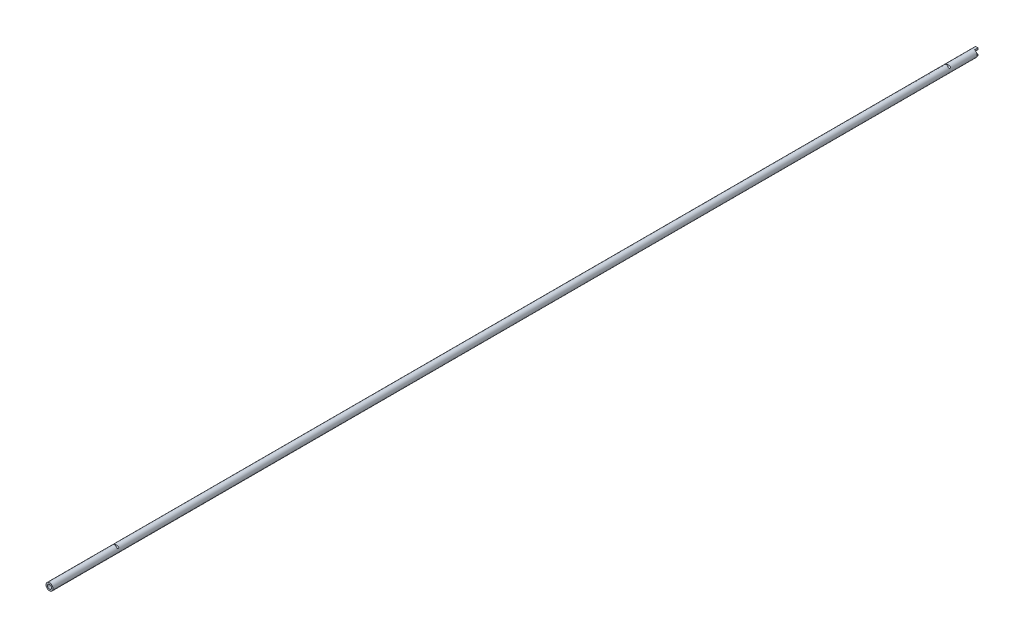
ISO-10303-21;
HEADER;
FILE_DESCRIPTION(('STEP AP214'),'2;1');
FILE_NAME('part.step','',(''),(''),'','','');
FILE_SCHEMA(('AUTOMOTIVE_DESIGN { 1 0 10303 214 1 1 1 1 }'));
ENDSEC;
DATA;
#1=APPLICATION_CONTEXT('core data for automotive mechanical design processes');
#2=APPLICATION_PROTOCOL_DEFINITION('international standard','automotive_design',2000,#1);
#3=PRODUCT_CONTEXT('',#1,'mechanical');
#4=PRODUCT('Part','Part','',(#3));
#5=PRODUCT_RELATED_PRODUCT_CATEGORY('part','',(#4));
#6=PRODUCT_DEFINITION_FORMATION('','',#4);
#7=PRODUCT_DEFINITION_CONTEXT('part definition',#1,'design');
#8=PRODUCT_DEFINITION('design','',#6,#7);
#9=PRODUCT_DEFINITION_SHAPE('','',#8);
#10=(LENGTH_UNIT() NAMED_UNIT(*) SI_UNIT(.MILLI.,.METRE.));
#11=(NAMED_UNIT(*) PLANE_ANGLE_UNIT() SI_UNIT($,.RADIAN.));
#12=(NAMED_UNIT(*) SI_UNIT($,.STERADIAN.) SOLID_ANGLE_UNIT());
#13=UNCERTAINTY_MEASURE_WITH_UNIT(LENGTH_MEASURE(1.E-05),#10,'distance_accuracy_value','');
#14=(GEOMETRIC_REPRESENTATION_CONTEXT(3) GLOBAL_UNCERTAINTY_ASSIGNED_CONTEXT((#13)) GLOBAL_UNIT_ASSIGNED_CONTEXT((#10,
#11,#12)) REPRESENTATION_CONTEXT('',''));
#15=CARTESIAN_POINT('',(0.,0.,0.));
#16=DIRECTION('',(0.,0.,1.));
#17=DIRECTION('',(1.,0.,0.));
#18=AXIS2_PLACEMENT_3D('',#15,#16,#17);
#19=CARTESIAN_POINT('',(0.,0.,0.));
#20=DIRECTION('',(0.,0.,1.));
#21=DIRECTION('',(1.,0.,0.));
#22=AXIS2_PLACEMENT_3D('',#19,#20,#21);
#23=PLANE('',#22);
#24=DIRECTION('',(0.,-1.,0.));
#25=VECTOR('',#24,1.);
#26=CARTESIAN_POINT('',(0.5,-3.,0.));
#27=LINE('',#26,#25);
#28=CARTESIAN_POINT('',(0.5,-1.00778221853732,0.));
#29=VERTEX_POINT('',#28);
#30=CARTESIAN_POINT('',(0.5,-1.91582880237249,0.));
#31=VERTEX_POINT('',#30);
#32=EDGE_CURVE('E81',#29,#31,#27,.T.);
#33=ORIENTED_EDGE('',*,*,#32,.T.);
#34=CARTESIAN_POINT('',(0.,0.,0.));
#35=DIRECTION('',(0.,0.,1.));
#36=DIRECTION('',(1.,0.,0.));
#37=AXIS2_PLACEMENT_3D('',#34,#35,#36);
#38=CIRCLE('',#37,1.98);
#39=CARTESIAN_POINT('',(0.5,1.91582880237249,0.));
#40=VERTEX_POINT('',#39);
#41=EDGE_CURVE('E86',#40,#31,#38,.T.);
#42=ORIENTED_EDGE('',*,*,#41,.F.);
#43=CARTESIAN_POINT('',(0.5,1.00778221853732,0.));
#44=VERTEX_POINT('',#43);
#45=EDGE_CURVE('E71',#40,#44,#27,.T.);
#46=ORIENTED_EDGE('',*,*,#45,.T.);
#47=CARTESIAN_POINT('',(0.,0.,0.));
#48=DIRECTION('',(0.,0.,1.));
#49=DIRECTION('',(1.,0.,0.));
#50=AXIS2_PLACEMENT_3D('',#47,#48,#49);
#51=CIRCLE('',#50,1.125);
#52=EDGE_CURVE('E97',#44,#29,#51,.T.);
#53=ORIENTED_EDGE('',*,*,#52,.T.);
#54=EDGE_LOOP('',(#33,#42,#46,#53));
#55=FACE_BOUND('',#54,.T.);
#56=ADVANCED_FACE('F31',(#55),#23,.F.);
#57=CARTESIAN_POINT('',(0.,0.,522.));
#58=DIRECTION('',(0.,0.,-1.));
#59=DIRECTION('',(-1.,0.,0.));
#60=AXIS2_PLACEMENT_3D('',#57,#58,#59);
#61=CYLINDRICAL_SURFACE('',#60,1.98);
#62=CARTESIAN_POINT('',(0.,0.,522.));
#63=DIRECTION('',(0.,0.,1.));
#64=DIRECTION('',(1.,0.,0.));
#65=AXIS2_PLACEMENT_3D('',#62,#63,#64);
#66=CIRCLE('',#65,1.98);
#67=CARTESIAN_POINT('',(1.98,0.,522.));
#68=VERTEX_POINT('',#67);
#69=EDGE_CURVE('E90',#68,#68,#66,.T.);
#70=ORIENTED_EDGE('',*,*,#69,.F.);
#71=EDGE_LOOP('',(#70));
#72=FACE_BOUND('',#71,.T.);
#73=CARTESIAN_POINT('',(-1.29243955371228,1.5,484.5));
#74=CARTESIAN_POINT('',(-1.2425389474271,1.54299057509264,484.499995399884));
#75=CARTESIAN_POINT('',(-1.19047392231772,1.58347850851822,484.505508981067));
#76=CARTESIAN_POINT('',(-1.08343395994787,1.65857997671562,484.524229338989));
#77=CARTESIAN_POINT('',(-1.02844770339114,1.69316808435268,484.537468379666));
#78=CARTESIAN_POINT('',(-0.927935323019706,1.74984443231153,484.565986907975));
#79=CARTESIAN_POINT('',(-0.882750131221038,1.77304535126958,484.580309265285));
#80=CARTESIAN_POINT('',(-0.791398755927703,1.81566270412915,484.611344998857));
#81=CARTESIAN_POINT('',(-0.745231912553682,1.83507649695735,484.628060029743));
#82=CARTESIAN_POINT('',(-0.651849804804599,1.87029295163725,484.663100115686));
#83=CARTESIAN_POINT('',(-0.604630419985961,1.88607686066688,484.681432883234));
#84=CARTESIAN_POINT('',(-0.509392580614743,1.91399586955475,484.718664103806));
#85=CARTESIAN_POINT('',(-0.461374601197777,1.92613306250905,484.737562225461));
#86=CARTESIAN_POINT('',(-0.360997039527152,1.94753669014353,484.77591783551));
#87=CARTESIAN_POINT('',(-0.308562990694924,1.95655445010748,484.795327153863));
#88=CARTESIAN_POINT('',(-0.22872453128644,1.96692338058287,484.820918499651));
#89=CARTESIAN_POINT('',(-0.202090998477371,1.96984440731773,484.828821563424));
#90=CARTESIAN_POINT('',(-0.148224117196186,1.9746301218412,484.842593790329));
#91=CARTESIAN_POINT('',(-0.120991479330969,1.97649599766511,484.848465238035));
#92=CARTESIAN_POINT('',(-0.0537707003767061,1.97966281507022,484.858667893243));
#93=CARTESIAN_POINT('',(-0.0134226939209415,1.98035783807444,484.861196492443));
#94=CARTESIAN_POINT('',(0.0669997380799987,1.97927973122775,484.857563998987));
#95=CARTESIAN_POINT('',(0.107071100296893,1.97749186794063,484.85135103103));
#96=CARTESIAN_POINT('',(0.194521419191953,1.97101763019431,484.831900637824));
#97=CARTESIAN_POINT('',(0.241530696902491,1.96577249467755,484.817403089104));
#98=CARTESIAN_POINT('',(0.334256756651982,1.95214388781263,484.785822963867));
#99=CARTESIAN_POINT('',(0.379969885338665,1.94375234271596,484.768733804995));
#100=CARTESIAN_POINT('',(0.470905320529795,1.92375480216822,484.73384143126));
#101=CARTESIAN_POINT('',(0.516119610868044,1.91212079962062,484.716033206489));
#102=CARTESIAN_POINT('',(0.605740692022154,1.88564557850313,484.681000126433));
#103=CARTESIAN_POINT('',(0.650148447531186,1.8708085084495,484.66377454959));
#104=CARTESIAN_POINT('',(0.770935820794457,1.82558570902771,484.618356590295));
#105=CARTESIAN_POINT('',(0.846634575466666,1.79182299971131,484.591491118236));
#106=CARTESIAN_POINT('',(0.957774985659008,1.73343901883518,484.557266659132));
#107=CARTESIAN_POINT('',(0.994368395059784,1.71272386397189,484.54688164087));
#108=CARTESIAN_POINT('',(1.06661052490458,1.66869091295037,484.528714351692));
#109=CARTESIAN_POINT('',(1.10225987616208,1.64537491188653,484.520930300244));
#110=CARTESIAN_POINT('',(1.17841918111783,1.5919321699588,484.507624992223));
#111=CARTESIAN_POINT('',(1.21870739676491,1.56132427402965,484.502725293343));
#112=CARTESIAN_POINT('',(1.29698308764005,1.49692709137292,484.49897275642));
#113=CARTESIAN_POINT('',(1.33497331533841,1.46314173967792,484.50011253334));
#114=CARTESIAN_POINT('',(1.39986058382865,1.40084150657203,484.509151431277));
#115=CARTESIAN_POINT('',(1.42738088148496,1.37276519308707,484.515536812193));
#116=CARTESIAN_POINT('',(1.47981222055676,1.31606880895236,484.534107607322));
#117=CARTESIAN_POINT('',(1.50472672580005,1.28744952146375,484.546285199386));
#118=CARTESIAN_POINT('',(1.54608832668868,1.23726620100832,484.57385402592));
#119=CARTESIAN_POINT('',(1.56319238779426,1.21553519132598,484.587948854681));
#120=CARTESIAN_POINT('',(1.59498928616176,1.1734998682079,484.6203934902));
#121=CARTESIAN_POINT('',(1.60968306160285,1.15319500142876,484.638741634656));
#122=CARTESIAN_POINT('',(1.63640788913332,1.11495261267294,484.679795141432));
#123=CARTESIAN_POINT('',(1.64841667126551,1.09703535476532,484.702534226151));
#124=CARTESIAN_POINT('',(1.66931844896994,1.06496225592531,484.751799210388));
#125=CARTESIAN_POINT('',(1.67821357379962,1.05080384613205,484.778322504555));
#126=CARTESIAN_POINT('',(1.6917224810794,1.02889185071128,484.830453260387));
#127=CARTESIAN_POINT('',(1.69675276974183,1.0205307737746,484.855698843924));
#128=CARTESIAN_POINT('',(1.70428755282627,1.00789835387624,484.907552256623));
#129=CARTESIAN_POINT('',(1.7067934155452,1.00362479544913,484.934159339595));
#130=CARTESIAN_POINT('',(1.70915519503846,0.999596416223082,484.98561098079));
#131=CARTESIAN_POINT('',(1.70921232766306,0.999498481861305,485.010420262358));
#132=CARTESIAN_POINT('',(1.70718214549105,1.00296220581874,485.059689084896));
#133=CARTESIAN_POINT('',(1.70509532165559,1.00652302629143,485.084148704639));
#134=CARTESIAN_POINT('',(1.69884588491489,1.01703431002156,485.131628657877));
#135=CARTESIAN_POINT('',(1.6947171064988,1.02392948411732,485.154665785105));
#136=CARTESIAN_POINT('',(1.68444215013575,1.04074548301759,485.199123817516));
#137=CARTESIAN_POINT('',(1.67829584570709,1.05066649751377,485.220544621266));
#138=CARTESIAN_POINT('',(1.6638228467858,1.07344338237103,485.261966616591));
#139=CARTESIAN_POINT('',(1.65543055966809,1.08638572683818,485.281897100842));
#140=CARTESIAN_POINT('',(1.63669779700143,1.11440751291463,485.319159098493));
#141=CARTESIAN_POINT('',(1.62635690378808,1.12948741251566,485.336490053276));
#142=CARTESIAN_POINT('',(1.60287986678945,1.16259300992371,485.369805875973));
#143=CARTESIAN_POINT('',(1.5895759841589,1.18076166434902,485.385529561474));
#144=CARTESIAN_POINT('',(1.56110199700591,1.2181606483445,485.413661038774));
#145=CARTESIAN_POINT('',(1.54593065516565,1.23739167710834,485.426066614645));
#146=CARTESIAN_POINT('',(1.50651990798003,1.28536031910428,485.452763101226));
#147=CARTESIAN_POINT('',(1.48135055703011,1.31434983631216,485.465236298156));
#148=CARTESIAN_POINT('',(1.42832263088195,1.3718001939425,485.484236298028));
#149=CARTESIAN_POINT('',(1.40045891145492,1.40025989421608,485.490751467447));
#150=CARTESIAN_POINT('',(1.33025691305691,1.4676802023986,485.500564016687));
#151=CARTESIAN_POINT('',(1.28684754331158,1.50589257629642,485.501272192347));
#152=CARTESIAN_POINT('',(1.19720223374585,1.57811403467986,485.495193011207));
#153=CARTESIAN_POINT('',(1.1509616919135,1.61211598873388,485.488393127331));
#154=CARTESIAN_POINT('',(1.06699590962419,1.66849696525275,485.47145638521));
#155=CARTESIAN_POINT('',(1.02964819787817,1.69178368721401,485.462389630505));
#156=CARTESIAN_POINT('',(0.95401677871399,1.73555832403956,485.4417004131));
#157=CARTESIAN_POINT('',(0.915732459823221,1.75604434966897,485.430076238927));
#158=CARTESIAN_POINT('',(0.799354675223509,1.81354633409486,485.392176081393));
#159=CARTESIAN_POINT('',(0.720107822723038,1.84635971886082,485.362959595014));
#160=CARTESIAN_POINT('',(0.596624773951927,1.88852357199507,485.315502753243));
#161=CARTESIAN_POINT('',(0.553150046817475,1.90170620113528,485.298436574337));
#162=CARTESIAN_POINT('',(0.465355957154523,1.92507384476332,485.264088759105));
#163=CARTESIAN_POINT('',(0.421035080891888,1.93525281873814,485.246806760489));
#164=CARTESIAN_POINT('',(0.332221827244607,1.95244629253874,485.213617508174));
#165=CARTESIAN_POINT('',(0.287746441345688,1.95951372824515,485.197691304867));
#166=CARTESIAN_POINT('',(0.197324771769674,1.97066515137824,485.169415328055));
#167=CARTESIAN_POINT('',(0.151385663990485,1.97476188217557,485.157050417164));
#168=CARTESIAN_POINT('',(0.0853757820768558,1.97825141722084,485.145907901098));
#169=CARTESIAN_POINT('',(0.0660399338863692,1.97899343914674,485.143418218213));
#170=CARTESIAN_POINT('',(0.0272113579580723,1.979908453452,485.140319621402));
#171=CARTESIAN_POINT('',(0.00771875088914758,1.98008184804194,485.139709378099));
#172=CARTESIAN_POINT('',(-0.0507133702426767,1.9797315556929,485.140940222663));
#173=CARTESIAN_POINT('',(-0.0895909543326028,1.97833652612027,485.14584593297));
#174=CARTESIAN_POINT('',(-0.17184917589707,1.97302915467368,485.16221383));
#175=CARTESIAN_POINT('',(-0.214996583299032,1.96876092843801,485.17457251831));
#176=CARTESIAN_POINT('',(-0.300090364524257,1.95759685108264,485.202072282246));
#177=CARTESIAN_POINT('',(-0.34203311193367,1.95069381121737,485.217220910821));
#178=CARTESIAN_POINT('',(-0.425673130100529,1.93417780143086,485.248614146769));
#179=CARTESIAN_POINT('',(-0.467358373064541,1.92452759451846,485.264871301597));
#180=CARTESIAN_POINT('',(-0.550001983414324,1.90255718472927,485.297205884567));
#181=CARTESIAN_POINT('',(-0.590961225229487,1.89024046889115,485.313283518867));
#182=CARTESIAN_POINT('',(-0.720434884318597,1.84665839679133,485.363165659877));
#183=CARTESIAN_POINT('',(-0.807942738804649,1.81020200184024,485.395464321881));
#184=CARTESIAN_POINT('',(-0.936084844687591,1.74539884469068,485.436381300634));
#185=CARTESIAN_POINT('',(-0.978168609555822,1.72218814885316,485.44874162515));
#186=CARTESIAN_POINT('',(-1.06112084574702,1.67235136707114,485.470137351687));
#187=CARTESIAN_POINT('',(-1.10199060155554,1.64572906176897,485.479176392006));
#188=CARTESIAN_POINT('',(-1.18118742674323,1.58980790851122,485.492689231832));
#189=CARTESIAN_POINT('',(-1.21955194843476,1.56058842064061,485.497267169679));
#190=CARTESIAN_POINT('',(-1.29421381934286,1.49924518184436,485.500941196703));
#191=CARTESIAN_POINT('',(-1.33051242581125,1.46712322874873,485.500040656709));
#192=CARTESIAN_POINT('',(-1.39463783661039,1.40606572105812,485.491900830439));
#193=CARTESIAN_POINT('',(-1.42288958741361,1.37744558369565,485.48570151981));
#194=CARTESIAN_POINT('',(-1.47670265710241,1.31958330785169,485.467298226666));
#195=CARTESIAN_POINT('',(-1.50226784623963,1.29034213915937,485.455103029827));
#196=CARTESIAN_POINT('',(-1.54430086866224,1.23949849702138,485.427512383048));
#197=CARTESIAN_POINT('',(-1.56149245709222,1.21772054087896,485.413549428843));
#198=CARTESIAN_POINT('',(-1.59347357154777,1.17555950118734,485.381366223341));
#199=CARTESIAN_POINT('',(-1.60826408935443,1.15517584373565,485.363147737447));
#200=CARTESIAN_POINT('',(-1.63519063343644,1.11673998258229,485.322340028014));
#201=CARTESIAN_POINT('',(-1.64730436272868,1.09870784028708,485.299716843124));
#202=CARTESIAN_POINT('',(-1.66841940688443,1.06637319292887,485.25065605032));
#203=CARTESIAN_POINT('',(-1.67742282187061,1.05206817287728,485.224221033364));
#204=CARTESIAN_POINT('',(-1.69114202490515,1.02984779489591,485.172185107904));
#205=CARTESIAN_POINT('',(-1.69627092088917,1.02133276794073,485.146947867889));
#206=CARTESIAN_POINT('',(-1.70399339036075,1.00839692228425,485.095075947843));
#207=CARTESIAN_POINT('',(-1.70658834816934,1.00397386815828,485.06844203922));
#208=CARTESIAN_POINT('',(-1.70910909924263,0.999675574278743,485.016942315836));
#209=CARTESIAN_POINT('',(-1.70923991053268,0.999451029473879,484.992114846078));
#210=CARTESIAN_POINT('',(-1.70735350547264,1.00267020352344,484.942785487486));
#211=CARTESIAN_POINT('',(-1.70533679000971,1.00611306699498,484.918283524082));
#212=CARTESIAN_POINT('',(-1.69922504563514,1.01639990952753,484.870720546983));
#213=CARTESIAN_POINT('',(-1.69516579961811,1.02318528974381,484.84764215547));
#214=CARTESIAN_POINT('',(-1.68502860898484,1.03979453603864,484.803082604735));
#215=CARTESIAN_POINT('',(-1.67895054015077,1.04961858908365,484.781601543896));
#216=CARTESIAN_POINT('',(-1.6646194876178,1.07220600199503,484.740059120452));
#217=CARTESIAN_POINT('',(-1.65630248337853,1.0850541969284,484.720066201585));
#218=CARTESIAN_POINT('',(-1.63771926529289,1.11290411032858,484.682665748489));
#219=CARTESIAN_POINT('',(-1.62745269824235,1.12790621890167,484.665258683762));
#220=CARTESIAN_POINT('',(-1.60414126089142,1.16084959421683,484.631793471622));
#221=CARTESIAN_POINT('',(-1.59093068570721,1.17893354496557,484.615992128616));
#222=CARTESIAN_POINT('',(-1.56263927764177,1.21618576100403,484.587691760744));
#223=CARTESIAN_POINT('',(-1.54755688573085,1.23535492283787,484.575195516173));
#224=CARTESIAN_POINT('',(-1.5084091130199,1.28313706926132,484.548302338409));
#225=CARTESIAN_POINT('',(-1.48341954980468,1.31201036305668,484.5357075766));
#226=CARTESIAN_POINT('',(-1.43076856097238,1.369240775342,484.51645321239));
#227=CARTESIAN_POINT('',(-1.40310461573342,1.39759737655735,484.509799268624));
#228=CARTESIAN_POINT('',(-1.34790540296918,1.45083234907983,484.501751960621));
#229=CARTESIAN_POINT('',(-1.32051505251853,1.47581228106136,484.500002588156));
#230=CARTESIAN_POINT('',(-1.29243955371228,1.5,484.5));
#231=B_SPLINE_CURVE_WITH_KNOTS('',3,(#73,#74,#75,#76,#77,#78,#79,#80,#81,#82,#83,#84,#85,#86,
#87,#88,#89,#90,#91,#92,#93,#94,#95,#96,#97,#98,#99,#100,#101,#102,#103,#104,#105,#106,#107,
#108,#109,#110,#111,#112,#113,#114,#115,#116,#117,#118,#119,#120,#121,#122,#123,#124,#125,#126,
#127,#128,#129,#130,#131,#132,#133,#134,#135,#136,#137,#138,#139,#140,#141,#142,#143,#144,#145,
#146,#147,#148,#149,#150,#151,#152,#153,#154,#155,#156,#157,#158,#159,#160,#161,#162,#163,#164,
#165,#166,#167,#168,#169,#170,#171,#172,#173,#174,#175,#176,#177,#178,#179,#180,#181,#182,#183,
#184,#185,#186,#187,#188,#189,#190,#191,#192,#193,#194,#195,#196,#197,#198,#199,#200,#201,#202,
#203,#204,#205,#206,#207,#208,#209,#210,#211,#212,#213,#214,#215,#216,#217,#218,#219,#220,#221,
#222,#223,#224,#225,#226,#227,#228,#229,#230),.UNSPECIFIED.,.T.,.F.,(4,2,2,2,2,2,2,2,2,2,2,2,2,
2,2,2,2,2,2,2,2,2,2,2,2,2,2,2,2,2,2,2,2,2,2,2,2,2,2,2,2,2,2,2,2,2,2,2,2,2,2,2,2,2,2,2,2,2,2,2,2,
2,2,2,2,2,2,2,2,2,2,2,2,2,2,2,2,2,4),(0.,0.19745979712818,0.39575021071411,0.553858524046532,
0.712076708141137,0.871094787957271,1.03002142145652,1.19966144685842,1.28339788572695,
1.36703985380876,1.48733678618054,1.6083506181656,1.75642554653167,1.90488306771142,
2.05466492126217,2.20425393343168,2.46463780357882,2.5944481117484,2.7241693733028,
2.87625710163995,3.02815890092498,3.14723850934875,3.26615776015639,3.35891465197994,
3.45163535301129,3.54509870811502,3.63849802337639,3.71925664612599,3.79997147225487,
3.87403992433136,3.94809141868067,4.02095506032273,4.09382327076713,4.16910981681471,
4.24441251817947,4.32648662408198,4.40861540532754,4.52903600681914,4.6496912401668,
4.8222405309063,4.99507815297783,5.12970451667404,5.26442125037054,5.53520194898285,
5.68072889427659,5.82654653818262,5.96977729855767,6.11238995049339,6.17083176247054,
6.22923222752353,6.34608162904459,6.48099878841783,6.61628671381844,6.7535036891945,
6.89054229599109,7.1895372827324,7.33822767845709,7.48675470226965,7.63172502000985,
7.77660614862582,7.89824678109111,8.01970970430939,8.11253434192106,8.20532053948779,
8.29885269921622,8.39232158086828,8.47325409616434,8.55414237227192,8.62826795693516,
8.70237625640103,8.77522924617059,8.84808671940274,8.9233020675771,8.99853105561198,
9.08043628013315,9.1624101869157,9.28236667327146,9.40243729681365,9.51353378864528),.UNSPECIFIED.);
#232=CARTESIAN_POINT('',(-1.29243955371228,1.5,484.5));
#233=VERTEX_POINT('',#232);
#234=EDGE_CURVE('E108',#233,#233,#231,.T.);
#235=ORIENTED_EDGE('',*,*,#234,.T.);
#236=EDGE_LOOP('',(#235));
#237=FACE_BOUND('',#236,.T.);
#238=CARTESIAN_POINT('',(-1.29243955371228,1.5,16.5));
#239=CARTESIAN_POINT('',(-1.24253894742711,1.54299057509263,16.4999953998844));
#240=CARTESIAN_POINT('',(-1.19047392231773,1.58347850851821,16.5055089810666));
#241=CARTESIAN_POINT('',(-1.0834339599479,1.6585799767156,16.5242293389891));
#242=CARTESIAN_POINT('',(-1.02844770339117,1.69316808435265,16.5374683796662));
#243=CARTESIAN_POINT('',(-0.927935323019754,1.74984443231151,16.5659869079752));
#244=CARTESIAN_POINT('',(-0.882750131221092,1.77304535126955,16.5803092652847));
#245=CARTESIAN_POINT('',(-0.79139875592777,1.81566270412912,16.6113449988573));
#246=CARTESIAN_POINT('',(-0.745231912553754,1.83507649695733,16.6280600297428));
#247=CARTESIAN_POINT('',(-0.651849804804683,1.87029295163722,16.6631001156865));
#248=CARTESIAN_POINT('',(-0.604630419986051,1.88607686066685,16.6814328832335));
#249=CARTESIAN_POINT('',(-0.50939258061484,1.91399586955472,16.7186641038058));
#250=CARTESIAN_POINT('',(-0.461374601197875,1.92613306250903,16.7375622254605));
#251=CARTESIAN_POINT('',(-0.360997039527259,1.94753669014351,16.7759178355098));
#252=CARTESIAN_POINT('',(-0.308562990695039,1.95655445010747,16.7953271538626));
#253=CARTESIAN_POINT('',(-0.228724531286567,1.96692338058285,16.8209184996514));
#254=CARTESIAN_POINT('',(-0.202090998477499,1.96984440731771,16.8288215634235));
#255=CARTESIAN_POINT('',(-0.148224117196311,1.97463012184119,16.8425937903295));
#256=CARTESIAN_POINT('',(-0.120991479331091,1.9764959976651,16.8484652380348));
#257=CARTESIAN_POINT('',(-0.0537707003768436,1.97966281507022,16.8586678932434));
#258=CARTESIAN_POINT('',(-0.0134226939211006,1.98035783807444,16.8611964924427));
#259=CARTESIAN_POINT('',(0.0669997380797977,1.97927973122775,16.8575639989868));
#260=CARTESIAN_POINT('',(0.107071100296672,1.97749186794065,16.8513510310298));
#261=CARTESIAN_POINT('',(0.194521419191673,1.97101763019434,16.831900637824));
#262=CARTESIAN_POINT('',(0.241530696902177,1.96577249467758,16.8174030891041));
#263=CARTESIAN_POINT('',(0.334256756651587,1.9521438878127,16.7858229638673));
#264=CARTESIAN_POINT('',(0.379969885338224,1.94375234271604,16.7687338049955));
#265=CARTESIAN_POINT('',(0.470905320529287,1.92375480216835,16.7338414312604));
#266=CARTESIAN_POINT('',(0.516119610867515,1.91212079962076,16.716033206489));
#267=CARTESIAN_POINT('',(0.605740692021549,1.88564557850333,16.6810001264332));
#268=CARTESIAN_POINT('',(0.650148447530529,1.87080850844973,16.6637745495905));
#269=CARTESIAN_POINT('',(0.770935820793831,1.82558570902797,16.6183565902952));
#270=CARTESIAN_POINT('',(0.846634575466134,1.79182299971157,16.5914911182364));
#271=CARTESIAN_POINT('',(0.957774985658594,1.73343901883541,16.5572666591322));
#272=CARTESIAN_POINT('',(0.994368395059403,1.71272386397212,16.54688164087));
#273=CARTESIAN_POINT('',(1.06661052490428,1.66869091295057,16.5287143516925));
#274=CARTESIAN_POINT('',(1.10225987616181,1.64537491188671,16.5209303002445));
#275=CARTESIAN_POINT('',(1.1784191811176,1.59193216995897,16.507624992223));
#276=CARTESIAN_POINT('',(1.21870739676467,1.56132427402983,16.5027252933435));
#277=CARTESIAN_POINT('',(1.29698308763982,1.49692709137312,16.4989727564203));
#278=CARTESIAN_POINT('',(1.33497331533818,1.46314173967813,16.5001125333403));
#279=CARTESIAN_POINT('',(1.39986058382844,1.40084150657224,16.5091514312769));
#280=CARTESIAN_POINT('',(1.42738088148477,1.37276519308727,16.5155368121933));
#281=CARTESIAN_POINT('',(1.4798122205566,1.31606880895254,16.5341076073223));
#282=CARTESIAN_POINT('',(1.50472672579991,1.28744952146392,16.5462851993862));
#283=CARTESIAN_POINT('',(1.54608832668856,1.23726620100848,16.5738540259202));
#284=CARTESIAN_POINT('',(1.56319238779414,1.21553519132614,16.5879488546809));
#285=CARTESIAN_POINT('',(1.59498928616166,1.17349986820805,16.6203934902003));
#286=CARTESIAN_POINT('',(1.60968306160276,1.15319500142889,16.638741634656));
#287=CARTESIAN_POINT('',(1.63640788913324,1.11495261267306,16.6797951414322));
#288=CARTESIAN_POINT('',(1.64841667126543,1.09703535476543,16.7025342261511));
#289=CARTESIAN_POINT('',(1.66931844896988,1.0649622559254,16.7517992103879));
#290=CARTESIAN_POINT('',(1.67821357379957,1.05080384613213,16.7783225045552));
#291=CARTESIAN_POINT('',(1.69172248107935,1.02889185071135,16.8304532603865));
#292=CARTESIAN_POINT('',(1.69675276974179,1.02053077377467,16.8556988439236));
#293=CARTESIAN_POINT('',(1.70428755282623,1.0078983538763,16.9075522566233));
#294=CARTESIAN_POINT('',(1.70679341554517,1.00362479544917,16.9341593395946));
#295=CARTESIAN_POINT('',(1.70915519503845,0.999596416223112,16.9856109807895));
#296=CARTESIAN_POINT('',(1.70921232766305,0.999498481861328,17.0104202623576));
#297=CARTESIAN_POINT('',(1.70718214549104,1.00296220581875,17.0596890848962));
#298=CARTESIAN_POINT('',(1.70509532165559,1.00652302629144,17.0841487046384));
#299=CARTESIAN_POINT('',(1.69884588491489,1.01703431002156,17.131628657877));
#300=CARTESIAN_POINT('',(1.69471710649881,1.0239294841173,17.1546657851046));
#301=CARTESIAN_POINT('',(1.68444215013577,1.04074548301757,17.1991238175159));
#302=CARTESIAN_POINT('',(1.67829584570711,1.05066649751374,17.2205446212663));
#303=CARTESIAN_POINT('',(1.66382284678582,1.073443382371,17.2619666165905));
#304=CARTESIAN_POINT('',(1.65543055966813,1.08638572683813,17.2818971008415));
#305=CARTESIAN_POINT('',(1.63669779700147,1.11440751291457,17.3191590984925));
#306=CARTESIAN_POINT('',(1.62635690378812,1.1294874125156,17.336490053276));
#307=CARTESIAN_POINT('',(1.60287986678949,1.16259300992365,17.3698058759727));
#308=CARTESIAN_POINT('',(1.58957598415895,1.18076166434895,17.385529561474));
#309=CARTESIAN_POINT('',(1.56110199700596,1.21816064834444,17.413661038774));
#310=CARTESIAN_POINT('',(1.5459306551657,1.23739167710827,17.4260666146446));
#311=CARTESIAN_POINT('',(1.50651990798008,1.28536031910421,17.4527631012258));
#312=CARTESIAN_POINT('',(1.48135055703017,1.31434983631209,17.465236298156));
#313=CARTESIAN_POINT('',(1.42832263088202,1.37180019394243,17.4842362980276));
#314=CARTESIAN_POINT('',(1.40045891145501,1.400259894216,17.4907514674465));
#315=CARTESIAN_POINT('',(1.33025691305702,1.4676802023985,17.5005640166868));
#316=CARTESIAN_POINT('',(1.2868475433117,1.50589257629632,17.501272192347));
#317=CARTESIAN_POINT('',(1.19720223374601,1.57811403467974,17.4951930112071));
#318=CARTESIAN_POINT('',(1.15096169191367,1.61211598873376,17.4883931273312));
#319=CARTESIAN_POINT('',(1.06699590962438,1.66849696525263,17.4714563852102));
#320=CARTESIAN_POINT('',(1.02964819787838,1.69178368721388,17.4623896305051));
#321=CARTESIAN_POINT('',(0.954016778714226,1.73555832403943,17.4417004130996));
#322=CARTESIAN_POINT('',(0.915732459823467,1.75604434966884,17.4300762389267));
#323=CARTESIAN_POINT('',(0.799354675223792,1.81354633409473,17.3921760813933));
#324=CARTESIAN_POINT('',(0.720107822723348,1.8463597188607,17.362959595014));
#325=CARTESIAN_POINT('',(0.596624773952271,1.88852357199496,17.3155027532434));
#326=CARTESIAN_POINT('',(0.553150046817824,1.90170620113518,17.2984365743369));
#327=CARTESIAN_POINT('',(0.465355957154908,1.92507384476323,17.2640887591049));
#328=CARTESIAN_POINT('',(0.421035080892304,1.93525281873805,17.2468067604888));
#329=CARTESIAN_POINT('',(0.332221827245071,1.95244629253866,17.2136175081743));
#330=CARTESIAN_POINT('',(0.287746441346168,1.95951372824508,17.1976913048672));
#331=CARTESIAN_POINT('',(0.1973247717702,1.97066515137818,17.1694153280556));
#332=CARTESIAN_POINT('',(0.15138566399104,1.97476188217552,17.1570504171643));
#333=CARTESIAN_POINT('',(0.0853757820774552,1.97825141722081,17.1459079010975));
#334=CARTESIAN_POINT('',(0.0660399338869947,1.97899343914672,17.1434182182129));
#335=CARTESIAN_POINT('',(0.0272113579587511,1.97990845345199,17.1403196214019));
#336=CARTESIAN_POINT('',(0.00771875088985361,1.98008184804194,17.1397093780989));
#337=CARTESIAN_POINT('',(-0.0507133702418913,1.97973155569292,17.1409402226625));
#338=CARTESIAN_POINT('',(-0.089590954331768,1.97833652612031,17.1458459329697));
#339=CARTESIAN_POINT('',(-0.171849175896004,1.97302915467377,17.1622138299995));
#340=CARTESIAN_POINT('',(-0.214996583297794,1.96876092843814,17.1745725183095));
#341=CARTESIAN_POINT('',(-0.300090364522659,1.95759685108288,17.2020722822457));
#342=CARTESIAN_POINT('',(-0.342033111931887,1.95069381121768,17.2172209108207));
#343=CARTESIAN_POINT('',(-0.425673130098382,1.93417780143133,17.248614146768));
#344=CARTESIAN_POINT('',(-0.467358373062217,1.92452759451902,17.2648713015959));
#345=CARTESIAN_POINT('',(-0.550001983411651,1.90255718473004,17.2972058845663));
#346=CARTESIAN_POINT('',(-0.590961225226642,1.89024046889203,17.3132835188654));
#347=CARTESIAN_POINT('',(-0.720434884315263,1.84665839679261,17.3631656598756));
#348=CARTESIAN_POINT('',(-0.807942738801001,1.81020200184185,17.3954643218793));
#349=CARTESIAN_POINT('',(-0.936084844683538,1.74539884469285,17.436381300633));
#350=CARTESIAN_POINT('',(-0.978168609551649,1.72218814885553,17.4487416251491));
#351=CARTESIAN_POINT('',(-1.06112084574261,1.67235136707393,17.4701373516854));
#352=CARTESIAN_POINT('',(-1.10199060155102,1.64572906177199,17.4791763920054));
#353=CARTESIAN_POINT('',(-1.1811874267389,1.58980790851444,17.4926892318312));
#354=CARTESIAN_POINT('',(-1.21955194843071,1.56058842064378,17.4972671696781));
#355=CARTESIAN_POINT('',(-1.29421381933938,1.49924518184738,17.5009411967026));
#356=CARTESIAN_POINT('',(-1.33051242580805,1.46712322875164,17.5000406567086));
#357=CARTESIAN_POINT('',(-1.39463783660767,1.40606572106083,17.4919008304395));
#358=CARTESIAN_POINT('',(-1.42288958741107,1.37744558369827,17.4857015198106));
#359=CARTESIAN_POINT('',(-1.47670265710026,1.31958330785411,17.4672982266667));
#360=CARTESIAN_POINT('',(-1.50226784623766,1.29034213916166,17.4551030298279));
#361=CARTESIAN_POINT('',(-1.54430086866059,1.23949849702345,17.4275123830495));
#362=CARTESIAN_POINT('',(-1.56149245709069,1.21772054088093,17.4135494288446));
#363=CARTESIAN_POINT('',(-1.59347357154647,1.17555950118911,17.3813662233423));
#364=CARTESIAN_POINT('',(-1.60826408935324,1.15517584373732,17.3631477374485));
#365=CARTESIAN_POINT('',(-1.63519063343545,1.11673998258374,17.3223400280157));
#366=CARTESIAN_POINT('',(-1.64730436272779,1.09870784028842,17.2997168431261));
#367=CARTESIAN_POINT('',(-1.66841940688376,1.06637319292992,17.2506560503222));
#368=CARTESIAN_POINT('',(-1.67742282187005,1.05206817287818,17.2242210333653));
#369=CARTESIAN_POINT('',(-1.69114202490475,1.02984779489657,17.1721851079058));
#370=CARTESIAN_POINT('',(-1.69627092088883,1.02133276794129,17.1469478678903));
#371=CARTESIAN_POINT('',(-1.70399339036054,1.0083969222846,17.0950759478447));
#372=CARTESIAN_POINT('',(-1.70658834816919,1.00397386815854,17.0684420392215));
#373=CARTESIAN_POINT('',(-1.70910909924258,0.999675574278825,17.0169423158379));
#374=CARTESIAN_POINT('',(-1.70923991053268,0.999451029473879,16.9921148460791));
#375=CARTESIAN_POINT('',(-1.70735350547273,1.00267020352328,16.9427854874878));
#376=CARTESIAN_POINT('',(-1.70533679000985,1.00611306699474,16.9182835240837));
#377=CARTESIAN_POINT('',(-1.69922504563537,1.01639990952713,16.8707205469841));
#378=CARTESIAN_POINT('',(-1.69516579961839,1.02318528974334,16.8476421554719));
#379=CARTESIAN_POINT('',(-1.6850286089852,1.03979453603804,16.8030826047369));
#380=CARTESIAN_POINT('',(-1.67895054015118,1.04961858908299,16.7816015438972));
#381=CARTESIAN_POINT('',(-1.66461948761829,1.07220600199427,16.7400591204533));
#382=CARTESIAN_POINT('',(-1.65630248337906,1.08505419692759,16.7200662015857));
#383=CARTESIAN_POINT('',(-1.63771926529352,1.11290411032765,16.6826657484897));
#384=CARTESIAN_POINT('',(-1.62745269824303,1.12790621890068,16.6652586837629));
#385=CARTESIAN_POINT('',(-1.60414126089221,1.16084959421574,16.6317934716225));
#386=CARTESIAN_POINT('',(-1.59093068570804,1.17893354496443,16.6159921286173));
#387=CARTESIAN_POINT('',(-1.56263927764272,1.2161857610028,16.5876917607453));
#388=CARTESIAN_POINT('',(-1.54755688573187,1.23535492283658,16.575195516174));
#389=CARTESIAN_POINT('',(-1.50840911302112,1.28313706925987,16.5483023384094));
#390=CARTESIAN_POINT('',(-1.48341954980603,1.31201036305515,16.5357075766008));
#391=CARTESIAN_POINT('',(-1.43076856097398,1.36924077534032,16.51645321239));
#392=CARTESIAN_POINT('',(-1.40310461573514,1.39759737655562,16.5097992686245));
#393=CARTESIAN_POINT('',(-1.34790540297046,1.45083234907867,16.5017519606214));
#394=CARTESIAN_POINT('',(-1.32051505251918,1.4758122810608,16.5000025881557));
#395=CARTESIAN_POINT('',(-1.29243955371228,1.5,16.5));
#396=B_SPLINE_CURVE_WITH_KNOTS('',3,(#238,#239,#240,#241,#242,#243,#244,#245,#246,#247,#248,
#249,#250,#251,#252,#253,#254,#255,#256,#257,#258,#259,#260,#261,#262,#263,#264,#265,#266,#267,
#268,#269,#270,#271,#272,#273,#274,#275,#276,#277,#278,#279,#280,#281,#282,#283,#284,#285,#286,
#287,#288,#289,#290,#291,#292,#293,#294,#295,#296,#297,#298,#299,#300,#301,#302,#303,#304,#305,
#306,#307,#308,#309,#310,#311,#312,#313,#314,#315,#316,#317,#318,#319,#320,#321,#322,#323,#324,
#325,#326,#327,#328,#329,#330,#331,#332,#333,#334,#335,#336,#337,#338,#339,#340,#341,#342,#343,
#344,#345,#346,#347,#348,#349,#350,#351,#352,#353,#354,#355,#356,#357,#358,#359,#360,#361,#362,
#363,#364,#365,#366,#367,#368,#369,#370,#371,#372,#373,#374,#375,#376,#377,#378,#379,#380,#381,
#382,#383,#384,#385,#386,#387,#388,#389,#390,#391,#392,#393,#394,#395),.UNSPECIFIED.,.T.,.F.,(4,
2,2,2,2,2,2,2,2,2,2,2,2,2,2,2,2,2,2,2,2,2,2,2,2,2,2,2,2,2,2,2,2,2,2,2,2,2,2,2,2,2,2,2,2,2,2,2,2,
2,2,2,2,2,2,2,2,2,2,2,2,2,2,2,2,2,2,2,2,2,2,2,2,2,2,2,2,2,4),(0.,0.197459797128156,
0.395750210714069,0.553858524046458,0.712076708141058,0.871094787957175,1.03002142145641,
1.1996614468583,1.28339788572684,1.36703985380865,1.48733678618038,1.60835061816538,
1.75642554653132,1.90488306771094,2.05466492126158,2.20425393343093,2.46463780357833,
2.59444811174803,2.72416937330256,2.87625710163969,3.02815890092471,3.14723850934852,
3.2661577601562,3.35891465197976,3.45163535301112,3.54509870811492,3.63849802337627,
3.71925664612579,3.79997147225471,3.87403992433122,3.94809141868054,4.0209550603226,
4.09382327076703,4.16910981681455,4.24441251817931,4.32648662408185,4.40861540532739,
4.52903600681901,4.64969124016662,4.82224053090608,4.99507815297756,5.12970451667374,
5.26442125037021,5.53520194898243,5.68072889427615,5.82654653818212,5.9697772985571,
6.11238995049279,6.17083176246986,6.22923222752277,6.34608162904368,6.48099878841631,
6.6162867138163,6.75350368919172,6.89054229598769,7.18953728272783,7.33822767845197,
7.48675470226395,7.63172502000499,7.77660614862179,7.89824678108759,8.01970970430638,
8.11253434191832,8.20532053948531,8.29885269921392,8.3923215808663,8.47325409616248,
8.55414237227025,8.62826795693348,8.70237625639932,8.7752292461689,8.84808671940113,
8.92330206757545,8.99853105561026,9.08043628013133,9.16241018691374,9.28236667326912,
9.40243729681099,9.51353378864519),.UNSPECIFIED.);
#397=CARTESIAN_POINT('',(-1.29243955371228,1.5,16.5));
#398=VERTEX_POINT('',#397);
#399=EDGE_CURVE('E109',#398,#398,#396,.T.);
#400=ORIENTED_EDGE('',*,*,#399,.T.);
#401=EDGE_LOOP('',(#400));
#402=FACE_BOUND('',#401,.T.);
#403=DIRECTION('',(0.,0.,-1.));
#404=VECTOR('',#403,1.);
#405=CARTESIAN_POINT('',(0.5,-1.91582880237249,522.));
#406=LINE('',#405,#404);
#407=CARTESIAN_POINT('',(0.5,-1.91582880237249,2.));
#408=VERTEX_POINT('',#407);
#409=EDGE_CURVE('E87',#408,#31,#406,.T.);
#410=ORIENTED_EDGE('',*,*,#409,.F.);
#411=CARTESIAN_POINT('',(0.,0.,2.));
#412=DIRECTION('',(0.,0.,1.));
#413=DIRECTION('',(1.,0.,0.));
#414=AXIS2_PLACEMENT_3D('',#411,#412,#413);
#415=CIRCLE('',#414,1.98);
#416=CARTESIAN_POINT('',(0.5,1.91582880237249,2.));
#417=VERTEX_POINT('',#416);
#418=EDGE_CURVE('E52',#408,#417,#415,.T.);
#419=ORIENTED_EDGE('',*,*,#418,.T.);
#420=DIRECTION('',(0.,0.,-1.));
#421=VECTOR('',#420,1.);
#422=CARTESIAN_POINT('',(0.5,1.91582880237249,522.));
#423=LINE('',#422,#421);
#424=EDGE_CURVE('E75',#40,#417,#423,.F.);
#425=ORIENTED_EDGE('',*,*,#424,.F.);
#426=ORIENTED_EDGE('',*,*,#41,.T.);
#427=EDGE_LOOP('',(#410,#419,#425,#426));
#428=FACE_BOUND('',#427,.T.);
#429=ADVANCED_FACE('F33',(#72,#237,#402,#428),#61,.T.);
#430=CARTESIAN_POINT('',(0.,0.,522.));
#431=DIRECTION('',(0.,0.,-1.));
#432=DIRECTION('',(-1.,0.,0.));
#433=AXIS2_PLACEMENT_3D('',#430,#431,#432);
#434=CYLINDRICAL_SURFACE('',#433,1.125);
#435=CARTESIAN_POINT('',(0.,0.,522.));
#436=DIRECTION('',(0.,0.,1.));
#437=DIRECTION('',(1.,0.,0.));
#438=AXIS2_PLACEMENT_3D('',#435,#436,#437);
#439=CIRCLE('',#438,1.125);
#440=CARTESIAN_POINT('',(1.125,0.,522.));
#441=VERTEX_POINT('',#440);
#442=EDGE_CURVE('E91',#441,#441,#439,.T.);
#443=ORIENTED_EDGE('',*,*,#442,.T.);
#444=EDGE_LOOP('',(#443));
#445=FACE_BOUND('',#444,.T.);
#446=CARTESIAN_POINT('',(0.,1.125,485.330718913883));
#447=CARTESIAN_POINT('',(-0.0425077160410661,1.12499837688006,485.330723065775));
#448=CARTESIAN_POINT('',(-0.0850727203251633,1.12257582874055,485.328027596838));
#449=CARTESIAN_POINT('',(-0.168961838280274,1.11303738293692,485.316730375561));
#450=CARTESIAN_POINT('',(-0.210285025242875,1.10591806698603,485.308124321337));
#451=CARTESIAN_POINT('',(-0.273663295784953,1.09147978312296,485.288427164737));
#452=CARTESIAN_POINT('',(-0.296755658450523,1.08540448456951,485.279746290849));
#453=CARTESIAN_POINT('',(-0.341175044125041,1.07226658424161,485.259217498653));
#454=CARTESIAN_POINT('',(-0.362506037344178,1.06520630504555,485.247376972512));
#455=CARTESIAN_POINT('',(-0.397475481522227,1.05256507231575,485.223461205505));
#456=CARTESIAN_POINT('',(-0.411696016340389,1.04706092839888,485.212200740542));
#457=CARTESIAN_POINT('',(-0.438149193516881,1.03626888755836,485.18744382091));
#458=CARTESIAN_POINT('',(-0.450384371598885,1.03098072135261,485.17395026361));
#459=CARTESIAN_POINT('',(-0.469922351794281,1.0221976625694,485.14782539493));
#460=CARTESIAN_POINT('',(-0.477721068508368,1.01855999999346,485.135614832507));
#461=CARTESIAN_POINT('',(-0.491346716485057,1.01205754844342,485.109940992274));
#462=CARTESIAN_POINT('',(-0.49717466939916,1.00919235917286,485.096478368169));
#463=CARTESIAN_POINT('',(-0.506571850477844,1.00450894250934,485.068490971362));
#464=CARTESIAN_POINT('',(-0.510124418492353,1.00269844600146,485.05395921383));
#465=CARTESIAN_POINT('',(-0.514664202962211,1.00037626075637,485.024398685353));
#466=CARTESIAN_POINT('',(-0.515652946284559,0.999863798988297,485.009370215626));
#467=CARTESIAN_POINT('',(-0.515039796539361,1.00017934485113,484.981178989712));
#468=CARTESIAN_POINT('',(-0.513732076365861,1.00085515114489,484.968006950994));
#469=CARTESIAN_POINT('',(-0.509151440054408,1.0031930799972,484.942103816456));
#470=CARTESIAN_POINT('',(-0.505878662421486,1.00485513304107,484.929372689625));
#471=CARTESIAN_POINT('',(-0.497538869638479,1.00901011993323,484.904680751761));
#472=CARTESIAN_POINT('',(-0.492473904938891,1.01150210406233,484.892719078798));
#473=CARTESIAN_POINT('',(-0.480772282304193,1.01711611018464,484.869757392781));
#474=CARTESIAN_POINT('',(-0.474134959413593,1.02023839865283,484.858757789292));
#475=CARTESIAN_POINT('',(-0.456373380720993,1.02833804872515,484.833320707758));
#476=CARTESIAN_POINT('',(-0.444547647831895,1.03353533032615,484.819442033652));
#477=CARTESIAN_POINT('',(-0.418806250204821,1.04423271551459,484.79392089254));
#478=CARTESIAN_POINT('',(-0.404886224763044,1.04973343541284,484.782283209767));
#479=CARTESIAN_POINT('',(-0.369404508521835,1.06285119481017,484.756718792064));
#480=CARTESIAN_POINT('',(-0.34706567765353,1.07040116703654,484.743840313829));
#481=CARTESIAN_POINT('',(-0.300385155038916,1.08443233924342,484.721656557116));
#482=CARTESIAN_POINT('',(-0.276039770069329,1.09091149935962,484.712358054604));
#483=CARTESIAN_POINT('',(-0.215935266874564,1.10466712159086,484.693568194024));
#484=CARTESIAN_POINT('',(-0.179552470977952,1.11120073157328,484.685528887451));
#485=CARTESIAN_POINT('',(-0.105606016397438,1.12065604153808,484.674193066216));
#486=CARTESIAN_POINT('',(-0.0680409184095222,1.12357314955663,484.670902580384));
#487=CARTESIAN_POINT('',(0.00812276538520839,1.12562903021354,484.668565332657));
#488=CARTESIAN_POINT('',(0.0467263358394683,1.12468609923821,484.669610344415));
#489=CARTESIAN_POINT('',(0.123230348526697,1.11888577047863,484.67631284028));
#490=CARTESIAN_POINT('',(0.161131419192742,1.11403206308173,484.681965976009));
#491=CARTESIAN_POINT('',(0.225682461023001,1.10248854354982,484.696609177609));
#492=CARTESIAN_POINT('',(0.252747300819929,1.09657699817306,484.704388743439));
#493=CARTESIAN_POINT('',(0.305133181773442,1.08316367160866,484.723619449718));
#494=CARTESIAN_POINT('',(0.33045713721288,1.07566463825455,484.735064263205));
#495=CARTESIAN_POINT('',(0.371245307735322,1.06213016552846,484.758354047748));
#496=CARTESIAN_POINT('',(0.387415428400564,1.05631492836899,484.769086536082));
#497=CARTESIAN_POINT('',(0.417818294274258,1.04466071575664,484.79301483562));
#498=CARTESIAN_POINT('',(0.432054013558783,1.03882179129053,484.806206789668));
#499=CARTESIAN_POINT('',(0.455012092692947,1.02893614999275,484.831941135601));
#500=CARTESIAN_POINT('',(0.464256173358391,1.02477996949292,484.843973423362));
#501=CARTESIAN_POINT('',(0.480767781766969,1.01713817878354,484.869531959345));
#502=CARTESIAN_POINT('',(0.488036097630551,1.01365230135706,484.883057608837));
#503=CARTESIAN_POINT('',(0.500252902560101,1.00768014695522,484.911492075725));
#504=CARTESIAN_POINT('',(0.505179778082067,1.00520321219146,484.926412314065));
#505=CARTESIAN_POINT('',(0.512268109970264,1.00161013083422,484.957053286451));
#506=CARTESIAN_POINT('',(0.514432269140661,1.0004926543141,484.972773222457));
#507=CARTESIAN_POINT('',(0.515734502337814,0.999821465550561,485.002062845811));
#508=CARTESIAN_POINT('',(0.515267842557974,1.00006347629587,485.015611801666));
#509=CARTESIAN_POINT('',(0.512233695371161,1.00162096213682,485.042405778431));
#510=CARTESIAN_POINT('',(0.509666593315122,1.00293624032876,485.055650854633));
#511=CARTESIAN_POINT('',(0.502698054329661,1.00644621838737,485.08101321571));
#512=CARTESIAN_POINT('',(0.498363657767342,1.00860867490622,485.093153717261));
#513=CARTESIAN_POINT('',(0.488070493775813,1.01362960600465,485.116565191944));
#514=CARTESIAN_POINT('',(0.482111139904983,1.01648833182562,485.127835849264));
#515=CARTESIAN_POINT('',(0.466273503036029,1.02387285459833,485.153431366788));
#516=CARTESIAN_POINT('',(0.455765085319817,1.0286205711866,485.167302900481));
#517=CARTESIAN_POINT('',(0.432670439865083,1.03854713397756,485.193007956441));
#518=CARTESIAN_POINT('',(0.420080438314574,1.0437267545891,485.204837695921));
#519=CARTESIAN_POINT('',(0.388041300161448,1.0561469531434,485.230817963254));
#520=CARTESIAN_POINT('',(0.367846180250163,1.06339410396088,485.244041699099));
#521=CARTESIAN_POINT('',(0.325401331636244,1.07714505902046,485.267159893312));
#522=CARTESIAN_POINT('',(0.303146807385546,1.08364704511301,485.277046318497));
#523=CARTESIAN_POINT('',(0.247411609700472,1.09797769359079,485.297656754034));
#524=CARTESIAN_POINT('',(0.213225234973498,1.10517101216465,485.306906462359));
#525=CARTESIAN_POINT('',(0.143502861125186,1.11637013241374,485.320789175817));
#526=CARTESIAN_POINT('',(0.107968212844307,1.12037904058777,485.325426681425));
#527=CARTESIAN_POINT('',(0.0602148641656127,1.12345205812907,485.32895630679));
#528=CARTESIAN_POINT('',(0.0481912689443185,1.12403184599404,485.329618534601));
#529=CARTESIAN_POINT('',(0.0241133231616835,1.12480608636031,485.330499294362));
#530=CARTESIAN_POINT('',(0.0120589668421864,1.1250004604611,485.330717736038));
#531=CARTESIAN_POINT('',(0.,1.125,485.330718913883));
#532=B_SPLINE_CURVE_WITH_KNOTS('',3,(#446,#447,#448,#449,#450,#451,#452,#453,#454,#455,#456,
#457,#458,#459,#460,#461,#462,#463,#464,#465,#466,#467,#468,#469,#470,#471,#472,#473,#474,#475,
#476,#477,#478,#479,#480,#481,#482,#483,#484,#485,#486,#487,#488,#489,#490,#491,#492,#493,#494,
#495,#496,#497,#498,#499,#500,#501,#502,#503,#504,#505,#506,#507,#508,#509,#510,#511,#512,#513,
#514,#515,#516,#517,#518,#519,#520,#521,#522,#523,#524,#525,#526,#527,#528,#529,#530,#531),
.UNSPECIFIED.,.T.,.F.,(4,2,2,2,2,2,2,2,2,2,2,2,2,2,2,2,2,2,2,2,2,2,2,2,2,2,2,2,2,2,2,2,2,2,2,2,
2,2,2,2,2,2,4),(0.,0.127478426262866,0.255049733262199,0.331060295768074,0.406894563526312,
0.463573322696989,0.520179111308788,0.56481842209733,0.60943455609242,0.654373739375521,
0.699286153304227,0.738856111158377,0.778423280292537,0.817945326022391,0.857484115688181,
0.914045990510258,0.970727310618268,1.05088450807411,1.13119268509687,1.24408002499842,
1.35711055448925,1.47254578447353,1.58787221189704,1.67393913175091,1.75985827625995,
1.82044988250527,1.88094725091858,1.92796603606389,1.97496603809006,2.02239184678499,
2.06977122249943,2.11024134204852,2.15070403854074,2.18975669058221,2.22882345529109,
2.28263899060467,2.33655318281325,2.41174634370968,2.48711923122181,2.59496595293162,
2.70270733690599,2.73886419609523,2.77502840952681),.UNSPECIFIED.);
#533=CARTESIAN_POINT('',(0.,1.125,485.330718913883));
#534=VERTEX_POINT('',#533);
#535=EDGE_CURVE('E101',#534,#534,#532,.T.);
#536=ORIENTED_EDGE('',*,*,#535,.F.);
#537=EDGE_LOOP('',(#536));
#538=FACE_BOUND('',#537,.T.);
#539=CARTESIAN_POINT('',(0.,1.125,17.3307189138831));
#540=CARTESIAN_POINT('',(-0.0425077160410622,1.12499837688006,17.3307230657747));
#541=CARTESIAN_POINT('',(-0.085072720325156,1.12257582874055,17.3280275968376));
#542=CARTESIAN_POINT('',(-0.168961838280261,1.11303738293693,17.3167303755612));
#543=CARTESIAN_POINT('',(-0.21028502524286,1.10591806698604,17.3081243213368));
#544=CARTESIAN_POINT('',(-0.273663295784938,1.09147978312297,17.2884271647367));
#545=CARTESIAN_POINT('',(-0.296755658450509,1.08540448456952,17.2797462908491));
#546=CARTESIAN_POINT('',(-0.341175044125018,1.07226658424161,17.2592174986531));
#547=CARTESIAN_POINT('',(-0.362506037344146,1.06520630504556,17.2473769725122));
#548=CARTESIAN_POINT('',(-0.397475481522188,1.05256507231576,17.2234612055045));
#549=CARTESIAN_POINT('',(-0.411696016340349,1.0470609283989,17.2122007405421));
#550=CARTESIAN_POINT('',(-0.438149193516851,1.03626888755837,17.1874438209104));
#551=CARTESIAN_POINT('',(-0.450384371598865,1.03098072135262,17.1739502636101));
#552=CARTESIAN_POINT('',(-0.469922351794256,1.02219766256942,17.1478253949304));
#553=CARTESIAN_POINT('',(-0.477721068508332,1.01855999999348,17.1356148325065));
#554=CARTESIAN_POINT('',(-0.491346716485007,1.01205754844344,17.1099409922742));
#555=CARTESIAN_POINT('',(-0.497174669399112,1.00919235917288,17.096478368169));
#556=CARTESIAN_POINT('',(-0.506571850477804,1.00450894250936,17.0684909713622));
#557=CARTESIAN_POINT('',(-0.510124418492312,1.00269844600148,17.0539592138296));
#558=CARTESIAN_POINT('',(-0.514664202962155,1.0003762607564,17.0243986853528));
#559=CARTESIAN_POINT('',(-0.515652946284501,0.999863798988327,17.0093702156257));
#560=CARTESIAN_POINT('',(-0.515039796539317,1.00017934485115,16.9811789897115));
#561=CARTESIAN_POINT('',(-0.513732076365819,1.00085515114492,16.9680069509941));
#562=CARTESIAN_POINT('',(-0.509151440054365,1.00319307999722,16.9421038164559));
#563=CARTESIAN_POINT('',(-0.505878662421439,1.0048551330411,16.9293726896246));
#564=CARTESIAN_POINT('',(-0.497538869638428,1.00901011993325,16.9046807517606));
#565=CARTESIAN_POINT('',(-0.492473904938846,1.01150210406235,16.8927190787978));
#566=CARTESIAN_POINT('',(-0.48077228230416,1.01711611018466,16.8697573927812));
#567=CARTESIAN_POINT('',(-0.474134959413563,1.02023839865284,16.8587577892919));
#568=CARTESIAN_POINT('',(-0.456373380720977,1.02833804872516,16.8333207077582));
#569=CARTESIAN_POINT('',(-0.444547647831889,1.03353533032616,16.8194420336517));
#570=CARTESIAN_POINT('',(-0.418806250204825,1.04423271551459,16.79392089254));
#571=CARTESIAN_POINT('',(-0.404886224763048,1.04973343541284,16.7822832097672));
#572=CARTESIAN_POINT('',(-0.369404508521847,1.06285119481017,16.7567187920635));
#573=CARTESIAN_POINT('',(-0.347065677653553,1.07040116703653,16.7438403138288));
#574=CARTESIAN_POINT('',(-0.300385155038951,1.08443233924341,16.7216565571157));
#575=CARTESIAN_POINT('',(-0.276039770069363,1.09091149935961,16.712358054604));
#576=CARTESIAN_POINT('',(-0.215935266874602,1.10466712159085,16.6935681940241));
#577=CARTESIAN_POINT('',(-0.179552470977999,1.11120073157327,16.6855288874509));
#578=CARTESIAN_POINT('',(-0.105606016397498,1.12065604153807,16.6741930662156));
#579=CARTESIAN_POINT('',(-0.0680409184095855,1.12357314955662,16.6709025803835));
#580=CARTESIAN_POINT('',(0.00812276538513224,1.12562903021354,16.6685653326567));
#581=CARTESIAN_POINT('',(0.0467263358393827,1.12468609923821,16.6696103444154));
#582=CARTESIAN_POINT('',(0.123230348526598,1.11888577047864,16.6763128402803));
#583=CARTESIAN_POINT('',(0.161131419192638,1.11403206308174,16.681965976009));
#584=CARTESIAN_POINT('',(0.225682461022896,1.10248854354985,16.6966091776086));
#585=CARTESIAN_POINT('',(0.252747300819827,1.09657699817308,16.7043887434386));
#586=CARTESIAN_POINT('',(0.305133181773356,1.08316367160869,16.7236194497176));
#587=CARTESIAN_POINT('',(0.330457137212807,1.07566463825458,16.735064263205));
#588=CARTESIAN_POINT('',(0.371245307735252,1.06213016552848,16.7583540477475));
#589=CARTESIAN_POINT('',(0.387415428400491,1.05631492836902,16.7690865360821));
#590=CARTESIAN_POINT('',(0.417818294274186,1.04466071575666,16.7930148356202));
#591=CARTESIAN_POINT('',(0.432054013558716,1.03882179129056,16.8062067896684));
#592=CARTESIAN_POINT('',(0.455012092692895,1.02893614999278,16.8319411356011));
#593=CARTESIAN_POINT('',(0.464256173358351,1.02477996949294,16.843973423362));
#594=CARTESIAN_POINT('',(0.480767781766934,1.01713817878356,16.8695319593447));
#595=CARTESIAN_POINT('',(0.488036097630513,1.01365230135708,16.8830576088372));
#596=CARTESIAN_POINT('',(0.50025290256006,1.00768014695525,16.9114920757252));
#597=CARTESIAN_POINT('',(0.505179778082026,1.00520321219148,16.9264123140646));
#598=CARTESIAN_POINT('',(0.512268109970219,1.00161013083425,16.9570532864505));
#599=CARTESIAN_POINT('',(0.514432269140613,1.00049265431413,16.9727732224571));
#600=CARTESIAN_POINT('',(0.515734502337763,0.999821465550588,17.002062845811));
#601=CARTESIAN_POINT('',(0.515267842557924,1.0000634762959,17.0156118016659));
#602=CARTESIAN_POINT('',(0.512233695371111,1.00162096213685,17.0424057784307));
#603=CARTESIAN_POINT('',(0.509666593315069,1.00293624032879,17.0556508546329));
#604=CARTESIAN_POINT('',(0.502698054329605,1.00644621838739,17.0810132157095));
#605=CARTESIAN_POINT('',(0.498363657767283,1.00860867490625,17.0931537172613));
#606=CARTESIAN_POINT('',(0.488070493775741,1.01362960600468,17.1165651919445));
#607=CARTESIAN_POINT('',(0.482111139904899,1.01648833182566,17.1278358492641));
#608=CARTESIAN_POINT('',(0.466273503035921,1.02387285459838,17.1534313667877));
#609=CARTESIAN_POINT('',(0.455765085319699,1.02862057118665,17.1673029004806));
#610=CARTESIAN_POINT('',(0.432670439864952,1.03854713397761,17.1930079564407));
#611=CARTESIAN_POINT('',(0.42008043831444,1.04372675458916,17.2048376959209));
#612=CARTESIAN_POINT('',(0.388041300161295,1.05614695314346,17.2308179632543));
#613=CARTESIAN_POINT('',(0.367846180249993,1.06339410396093,17.2440416990992));
#614=CARTESIAN_POINT('',(0.325401331636042,1.07714505902052,17.2671598933121));
#615=CARTESIAN_POINT('',(0.30314680738533,1.08364704511307,17.2770463184965));
#616=CARTESIAN_POINT('',(0.247411609700226,1.09797769359084,17.2976567540345));
#617=CARTESIAN_POINT('',(0.213225234973234,1.1051710121647,17.3069064623592));
#618=CARTESIAN_POINT('',(0.143502861124894,1.11637013241378,17.3207891758173));
#619=CARTESIAN_POINT('',(0.107968212844004,1.1203790405878,17.3254266814249));
#620=CARTESIAN_POINT('',(0.060214864165351,1.12345205812909,17.3289563067903));
#621=CARTESIAN_POINT('',(0.0481912689441084,1.12403184599404,17.3296185346014));
#622=CARTESIAN_POINT('',(0.0241133231615779,1.12480608636031,17.3304992943623));
#623=CARTESIAN_POINT('',(0.0120589668421336,1.1250004604611,17.3307177360376));
#624=CARTESIAN_POINT('',(0.,1.125,17.3307189138831));
#625=B_SPLINE_CURVE_WITH_KNOTS('',3,(#539,#540,#541,#542,#543,#544,#545,#546,#547,#548,#549,
#550,#551,#552,#553,#554,#555,#556,#557,#558,#559,#560,#561,#562,#563,#564,#565,#566,#567,#568,
#569,#570,#571,#572,#573,#574,#575,#576,#577,#578,#579,#580,#581,#582,#583,#584,#585,#586,#587,
#588,#589,#590,#591,#592,#593,#594,#595,#596,#597,#598,#599,#600,#601,#602,#603,#604,#605,#606,
#607,#608,#609,#610,#611,#612,#613,#614,#615,#616,#617,#618,#619,#620,#621,#622,#623,#624),
.UNSPECIFIED.,.T.,.F.,(4,2,2,2,2,2,2,2,2,2,2,2,2,2,2,2,2,2,2,2,2,2,2,2,2,2,2,2,2,2,2,2,2,2,2,2,
2,2,2,2,2,2,4),(0.,0.127478426262856,0.255049733262192,0.331060295768059,0.406894563526282,
0.463573322696937,0.520179111308756,0.564818422097316,0.609434556092328,0.654373739375499,
0.699286153304049,0.738856111158242,0.77842328029247,0.817945326022266,0.857484115688067,
0.914045990510105,0.970727310618095,1.05088450807392,1.13119268509668,1.24408002499823,
1.35711055448903,1.47254578447328,1.58787221189677,1.67393913175065,1.75985827625971,
1.82044988250506,1.88094725091837,1.92796603606371,1.97496603808988,2.02239184678483,
2.06977122249925,2.11024134204829,2.15070403854049,2.18975669058198,2.22882345529096,
2.28263899060452,2.33655318281312,2.41174634370959,2.48711923122176,2.5949659529316,
2.702707336906,2.73886419609508,2.7750284095265),.UNSPECIFIED.);
#626=CARTESIAN_POINT('',(0.,1.125,17.3307189138831));
#627=VERTEX_POINT('',#626);
#628=EDGE_CURVE('E110',#627,#627,#625,.T.);
#629=ORIENTED_EDGE('',*,*,#628,.F.);
#630=EDGE_LOOP('',(#629));
#631=FACE_BOUND('',#630,.T.);
#632=CARTESIAN_POINT('',(0.,0.,2.));
#633=DIRECTION('',(0.,0.,1.));
#634=DIRECTION('',(1.,0.,0.));
#635=AXIS2_PLACEMENT_3D('',#632,#633,#634);
#636=CIRCLE('',#635,1.125);
#637=CARTESIAN_POINT('',(0.5,-1.00778221853732,2.));
#638=VERTEX_POINT('',#637);
#639=CARTESIAN_POINT('',(0.5,1.00778221853732,2.));
#640=VERTEX_POINT('',#639);
#641=EDGE_CURVE('E94',#638,#640,#636,.T.);
#642=ORIENTED_EDGE('',*,*,#641,.F.);
#643=DIRECTION('',(0.,0.,-1.));
#644=VECTOR('',#643,1.);
#645=CARTESIAN_POINT('',(0.5,-1.00778221853732,522.));
#646=LINE('',#645,#644);
#647=EDGE_CURVE('E11',#638,#29,#646,.T.);
#648=ORIENTED_EDGE('',*,*,#647,.T.);
#649=ORIENTED_EDGE('',*,*,#52,.F.);
#650=DIRECTION('',(0.,0.,-1.));
#651=VECTOR('',#650,1.);
#652=CARTESIAN_POINT('',(0.5,1.00778221853732,522.));
#653=LINE('',#652,#651);
#654=EDGE_CURVE('E40',#44,#640,#653,.F.);
#655=ORIENTED_EDGE('',*,*,#654,.T.);
#656=EDGE_LOOP('',(#642,#648,#649,#655));
#657=FACE_BOUND('',#656,.T.);
#658=ADVANCED_FACE('F115',(#445,#538,#631,#657),#434,.F.);
#659=CARTESIAN_POINT('',(0.,0.,522.));
#660=DIRECTION('',(0.,0.,1.));
#661=DIRECTION('',(1.,0.,0.));
#662=AXIS2_PLACEMENT_3D('',#659,#660,#661);
#663=PLANE('',#662);
#664=ORIENTED_EDGE('',*,*,#69,.T.);
#665=EDGE_LOOP('',(#664));
#666=FACE_BOUND('',#665,.T.);
#667=ORIENTED_EDGE('',*,*,#442,.F.);
#668=EDGE_LOOP('',(#667));
#669=FACE_BOUND('',#668,.T.);
#670=ADVANCED_FACE('F122',(#666,#669),#663,.T.);
#671=CARTESIAN_POINT('',(-1.98,1.5,485.));
#672=DIRECTION('',(1.,0.,0.));
#673=DIRECTION('',(0.,0.,-1.));
#674=AXIS2_PLACEMENT_3D('',#671,#672,#673);
#675=CYLINDRICAL_SURFACE('',#674,0.500000000000026);
#676=ORIENTED_EDGE('',*,*,#535,.T.);
#677=EDGE_LOOP('',(#676));
#678=FACE_BOUND('',#677,.T.);
#679=ORIENTED_EDGE('',*,*,#234,.F.);
#680=EDGE_LOOP('',(#679));
#681=FACE_BOUND('',#680,.T.);
#682=ADVANCED_FACE('F118',(#678,#681),#675,.F.);
#683=CARTESIAN_POINT('',(-1.98,1.5,17.));
#684=DIRECTION('',(1.,0.,0.));
#685=DIRECTION('',(0.,0.,-1.));
#686=AXIS2_PLACEMENT_3D('',#683,#684,#685);
#687=CYLINDRICAL_SURFACE('',#686,0.499999999999999);
#688=ORIENTED_EDGE('',*,*,#628,.T.);
#689=EDGE_LOOP('',(#688));
#690=FACE_BOUND('',#689,.T.);
#691=ORIENTED_EDGE('',*,*,#399,.F.);
#692=EDGE_LOOP('',(#691));
#693=FACE_BOUND('',#692,.T.);
#694=ADVANCED_FACE('F121',(#690,#693),#687,.F.);
#695=CARTESIAN_POINT('',(0.5,-3.,2.));
#696=DIRECTION('',(1.,0.,0.));
#697=DIRECTION('',(0.,0.,-1.));
#698=AXIS2_PLACEMENT_3D('',#695,#696,#697);
#699=PLANE('',#698);
#700=ORIENTED_EDGE('',*,*,#409,.T.);
#701=ORIENTED_EDGE('',*,*,#32,.F.);
#702=ORIENTED_EDGE('',*,*,#647,.F.);
#703=DIRECTION('',(0.,-1.,0.));
#704=VECTOR('',#703,1.);
#705=CARTESIAN_POINT('',(0.5,-3.,2.));
#706=LINE('',#705,#704);
#707=EDGE_CURVE('E47',#638,#408,#706,.T.);
#708=ORIENTED_EDGE('',*,*,#707,.T.);
#709=EDGE_LOOP('',(#700,#701,#702,#708));
#710=FACE_BOUND('',#709,.T.);
#711=ADVANCED_FACE('F138',(#710),#699,.T.);
#712=ORIENTED_EDGE('',*,*,#424,.T.);
#713=EDGE_CURVE('E141',#417,#640,#706,.T.);
#714=ORIENTED_EDGE('',*,*,#713,.T.);
#715=ORIENTED_EDGE('',*,*,#654,.F.);
#716=ORIENTED_EDGE('',*,*,#45,.F.);
#717=EDGE_LOOP('',(#712,#714,#715,#716));
#718=FACE_BOUND('',#717,.T.);
#719=ADVANCED_FACE('F73',(#718),#699,.T.);
#720=CARTESIAN_POINT('',(3.19841742235218,-3.,2.));
#721=DIRECTION('',(0.,0.,1.));
#722=DIRECTION('',(1.,0.,0.));
#723=AXIS2_PLACEMENT_3D('',#720,#721,#722);
#724=PLANE('',#723);
#725=ORIENTED_EDGE('',*,*,#707,.F.);
#726=ORIENTED_EDGE('',*,*,#641,.T.);
#727=ORIENTED_EDGE('',*,*,#713,.F.);
#728=ORIENTED_EDGE('',*,*,#418,.F.);
#729=EDGE_LOOP('',(#725,#726,#727,#728));
#730=FACE_BOUND('',#729,.T.);
#731=ADVANCED_FACE('F214',(#730),#724,.F.);
#732=CLOSED_SHELL('',(#56,#429,#658,#670,#682,#694,#711,#719,#731));
#733=MANIFOLD_SOLID_BREP('B2',#732);
#734=ADVANCED_BREP_SHAPE_REPRESENTATION('',(#18,#733),#14);
#735=SHAPE_DEFINITION_REPRESENTATION(#9,#734);
ENDSEC;
END-ISO-10303-21;
